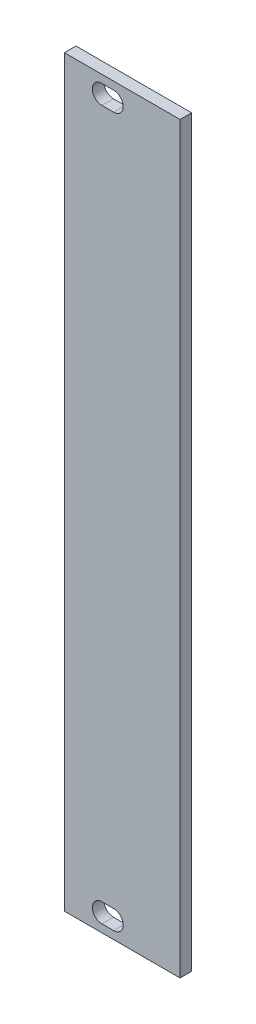
ISO-10303-21;
HEADER;
FILE_DESCRIPTION(('STEP AP214'),'2;1');
FILE_NAME('part.step','',(''),(''),'','','');
FILE_SCHEMA(('AUTOMOTIVE_DESIGN { 1 0 10303 214 1 1 1 1 }'));
ENDSEC;
DATA;
#1=APPLICATION_CONTEXT('core data for automotive mechanical design processes');
#2=APPLICATION_PROTOCOL_DEFINITION('international standard','automotive_design',2000,#1);
#3=PRODUCT_CONTEXT('',#1,'mechanical');
#4=PRODUCT('Part','Part','',(#3));
#5=PRODUCT_RELATED_PRODUCT_CATEGORY('part','',(#4));
#6=PRODUCT_DEFINITION_FORMATION('','',#4);
#7=PRODUCT_DEFINITION_CONTEXT('part definition',#1,'design');
#8=PRODUCT_DEFINITION('design','',#6,#7);
#9=PRODUCT_DEFINITION_SHAPE('','',#8);
#10=(LENGTH_UNIT() NAMED_UNIT(*) SI_UNIT(.MILLI.,.METRE.));
#11=(NAMED_UNIT(*) PLANE_ANGLE_UNIT() SI_UNIT($,.RADIAN.));
#12=(NAMED_UNIT(*) SI_UNIT($,.STERADIAN.) SOLID_ANGLE_UNIT());
#13=UNCERTAINTY_MEASURE_WITH_UNIT(LENGTH_MEASURE(1.E-05),#10,'distance_accuracy_value','');
#14=(GEOMETRIC_REPRESENTATION_CONTEXT(3) GLOBAL_UNCERTAINTY_ASSIGNED_CONTEXT((#13)) GLOBAL_UNIT_ASSIGNED_CONTEXT((#10,
#11,#12)) REPRESENTATION_CONTEXT('',''));
#15=CARTESIAN_POINT('',(0.,0.,0.));
#16=DIRECTION('',(0.,0.,1.));
#17=DIRECTION('',(1.,0.,0.));
#18=AXIS2_PLACEMENT_3D('',#15,#16,#17);
#19=CARTESIAN_POINT('',(0.,0.,2.));
#20=DIRECTION('',(0.,0.,1.));
#21=DIRECTION('',(1.,0.,0.));
#22=AXIS2_PLACEMENT_3D('',#19,#20,#21);
#23=PLANE('',#22);
#24=DIRECTION('',(0.,1.,0.));
#25=VECTOR('',#24,1.);
#26=CARTESIAN_POINT('',(10.,64.25,2.));
#27=LINE('',#26,#25);
#28=CARTESIAN_POINT('',(10.,-64.25,2.));
#29=VERTEX_POINT('',#28);
#30=CARTESIAN_POINT('',(10.,64.25,2.));
#31=VERTEX_POINT('',#30);
#32=EDGE_CURVE('E226',#29,#31,#27,.T.);
#33=ORIENTED_EDGE('',*,*,#32,.T.);
#34=DIRECTION('',(-1.,0.,0.));
#35=VECTOR('',#34,1.);
#36=CARTESIAN_POINT('',(-10.,64.25,2.));
#37=LINE('',#36,#35);
#38=CARTESIAN_POINT('',(-10.,64.25,2.));
#39=VERTEX_POINT('',#38);
#40=EDGE_CURVE('E230',#31,#39,#37,.T.);
#41=ORIENTED_EDGE('',*,*,#40,.T.);
#42=DIRECTION('',(0.,-1.,0.));
#43=VECTOR('',#42,1.);
#44=CARTESIAN_POINT('',(-10.,64.25,2.));
#45=LINE('',#44,#43);
#46=CARTESIAN_POINT('',(-9.99999999999999,-64.25,2.));
#47=VERTEX_POINT('',#46);
#48=EDGE_CURVE('E234',#39,#47,#45,.T.);
#49=ORIENTED_EDGE('',*,*,#48,.T.);
#50=DIRECTION('',(1.,0.,0.));
#51=VECTOR('',#50,1.);
#52=CARTESIAN_POINT('',(-9.99999999999999,-64.25,2.));
#53=LINE('',#52,#51);
#54=EDGE_CURVE('E237',#47,#29,#53,.T.);
#55=ORIENTED_EDGE('',*,*,#54,.T.);
#56=EDGE_LOOP('',(#33,#41,#49,#55));
#57=FACE_BOUND('',#56,.T.);
#58=DIRECTION('',(1.,0.,0.));
#59=VECTOR('',#58,1.);
#60=CARTESIAN_POINT('',(-3.51599999999999,-62.9,2.));
#61=LINE('',#60,#59);
#62=CARTESIAN_POINT('',(-3.51599999999999,-62.9,2.));
#63=VERTEX_POINT('',#62);
#64=CARTESIAN_POINT('',(-1.48399999999999,-62.9,2.));
#65=VERTEX_POINT('',#64);
#66=EDGE_CURVE('E186',#63,#65,#61,.T.);
#67=ORIENTED_EDGE('',*,*,#66,.F.);
#68=CARTESIAN_POINT('',(-3.51599999999999,-61.25,2.));
#69=DIRECTION('',(0.,0.,1.));
#70=DIRECTION('',(1.,0.,0.));
#71=AXIS2_PLACEMENT_3D('',#68,#69,#70);
#72=CIRCLE('',#71,1.65);
#73=CARTESIAN_POINT('',(-3.51599999999999,-59.6,2.));
#74=VERTEX_POINT('',#73);
#75=EDGE_CURVE('E183',#74,#63,#72,.T.);
#76=ORIENTED_EDGE('',*,*,#75,.F.);
#77=DIRECTION('',(-1.,0.,0.));
#78=VECTOR('',#77,1.);
#79=CARTESIAN_POINT('',(-3.51599999999999,-59.6,2.));
#80=LINE('',#79,#78);
#81=CARTESIAN_POINT('',(-1.48399999999999,-59.6,2.));
#82=VERTEX_POINT('',#81);
#83=EDGE_CURVE('E194',#82,#74,#80,.T.);
#84=ORIENTED_EDGE('',*,*,#83,.F.);
#85=CARTESIAN_POINT('',(-1.48399999999999,-61.25,2.));
#86=DIRECTION('',(0.,0.,1.));
#87=DIRECTION('',(1.,0.,0.));
#88=AXIS2_PLACEMENT_3D('',#85,#86,#87);
#89=CIRCLE('',#88,1.65);
#90=EDGE_CURVE('E190',#65,#82,#89,.T.);
#91=ORIENTED_EDGE('',*,*,#90,.F.);
#92=EDGE_LOOP('',(#67,#76,#84,#91));
#93=FACE_BOUND('',#92,.T.);
#94=DIRECTION('',(1.,0.,0.));
#95=VECTOR('',#94,1.);
#96=CARTESIAN_POINT('',(-3.51600000000001,59.6,2.));
#97=LINE('',#96,#95);
#98=CARTESIAN_POINT('',(-3.51600000000001,59.6,2.));
#99=VERTEX_POINT('',#98);
#100=CARTESIAN_POINT('',(-1.48400000000001,59.6,2.));
#101=VERTEX_POINT('',#100);
#102=EDGE_CURVE('E144',#99,#101,#97,.T.);
#103=ORIENTED_EDGE('',*,*,#102,.F.);
#104=CARTESIAN_POINT('',(-3.51600000000001,61.25,2.));
#105=DIRECTION('',(0.,0.,1.));
#106=DIRECTION('',(1.,0.,0.));
#107=AXIS2_PLACEMENT_3D('',#104,#105,#106);
#108=CIRCLE('',#107,1.65);
#109=CARTESIAN_POINT('',(-3.51600000000001,62.9,2.));
#110=VERTEX_POINT('',#109);
#111=EDGE_CURVE('E135',#110,#99,#108,.T.);
#112=ORIENTED_EDGE('',*,*,#111,.F.);
#113=DIRECTION('',(-1.,0.,0.));
#114=VECTOR('',#113,1.);
#115=CARTESIAN_POINT('',(-3.51600000000001,62.9,2.));
#116=LINE('',#115,#114);
#117=CARTESIAN_POINT('',(-1.48400000000001,62.9,2.));
#118=VERTEX_POINT('',#117);
#119=EDGE_CURVE('E161',#118,#110,#116,.T.);
#120=ORIENTED_EDGE('',*,*,#119,.F.);
#121=CARTESIAN_POINT('',(-1.48400000000001,61.25,2.));
#122=DIRECTION('',(0.,0.,1.));
#123=DIRECTION('',(1.,0.,0.));
#124=AXIS2_PLACEMENT_3D('',#121,#122,#123);
#125=CIRCLE('',#124,1.65);
#126=EDGE_CURVE('E157',#101,#118,#125,.T.);
#127=ORIENTED_EDGE('',*,*,#126,.F.);
#128=EDGE_LOOP('',(#103,#112,#120,#127));
#129=FACE_BOUND('',#128,.T.);
#130=ADVANCED_FACE('F45',(#57,#93,#129),#23,.T.);
#131=CARTESIAN_POINT('',(0.,0.,0.));
#132=DIRECTION('',(0.,0.,1.));
#133=DIRECTION('',(1.,0.,0.));
#134=AXIS2_PLACEMENT_3D('',#131,#132,#133);
#135=PLANE('',#134);
#136=CARTESIAN_POINT('',(-3.51599999999999,-61.25,0.));
#137=DIRECTION('',(0.,0.,1.));
#138=DIRECTION('',(1.,0.,0.));
#139=AXIS2_PLACEMENT_3D('',#136,#137,#138);
#140=CIRCLE('',#139,1.65);
#141=CARTESIAN_POINT('',(-3.51599999999999,-59.6,0.));
#142=VERTEX_POINT('',#141);
#143=CARTESIAN_POINT('',(-3.51599999999999,-62.9,0.));
#144=VERTEX_POINT('',#143);
#145=EDGE_CURVE('E153',#142,#144,#140,.T.);
#146=ORIENTED_EDGE('',*,*,#145,.T.);
#147=DIRECTION('',(1.,0.,0.));
#148=VECTOR('',#147,1.);
#149=CARTESIAN_POINT('',(-3.51599999999999,-62.9,0.));
#150=LINE('',#149,#148);
#151=CARTESIAN_POINT('',(-1.48399999999999,-62.9,0.));
#152=VERTEX_POINT('',#151);
#153=EDGE_CURVE('E201',#144,#152,#150,.T.);
#154=ORIENTED_EDGE('',*,*,#153,.T.);
#155=CARTESIAN_POINT('',(-1.48399999999999,-61.25,0.));
#156=DIRECTION('',(0.,0.,1.));
#157=DIRECTION('',(1.,0.,0.));
#158=AXIS2_PLACEMENT_3D('',#155,#156,#157);
#159=CIRCLE('',#158,1.65);
#160=CARTESIAN_POINT('',(-1.48399999999999,-59.6,0.));
#161=VERTEX_POINT('',#160);
#162=EDGE_CURVE('E205',#152,#161,#159,.T.);
#163=ORIENTED_EDGE('',*,*,#162,.T.);
#164=DIRECTION('',(-1.,0.,0.));
#165=VECTOR('',#164,1.);
#166=CARTESIAN_POINT('',(-3.51599999999999,-59.6,0.));
#167=LINE('',#166,#165);
#168=EDGE_CURVE('E187',#161,#142,#167,.T.);
#169=ORIENTED_EDGE('',*,*,#168,.T.);
#170=EDGE_LOOP('',(#146,#154,#163,#169));
#171=FACE_BOUND('',#170,.T.);
#172=DIRECTION('',(0.,1.,0.));
#173=VECTOR('',#172,1.);
#174=CARTESIAN_POINT('',(10.,64.25,0.));
#175=LINE('',#174,#173);
#176=CARTESIAN_POINT('',(10.,-64.25,0.));
#177=VERTEX_POINT('',#176);
#178=CARTESIAN_POINT('',(10.,64.25,0.));
#179=VERTEX_POINT('',#178);
#180=EDGE_CURVE('E225',#177,#179,#175,.T.);
#181=ORIENTED_EDGE('',*,*,#180,.F.);
#182=DIRECTION('',(1.,0.,0.));
#183=VECTOR('',#182,1.);
#184=CARTESIAN_POINT('',(-9.99999999999999,-64.25,0.));
#185=LINE('',#184,#183);
#186=CARTESIAN_POINT('',(-9.99999999999999,-64.25,0.));
#187=VERTEX_POINT('',#186);
#188=EDGE_CURVE('E231',#187,#177,#185,.T.);
#189=ORIENTED_EDGE('',*,*,#188,.F.);
#190=DIRECTION('',(0.,-1.,0.));
#191=VECTOR('',#190,1.);
#192=CARTESIAN_POINT('',(-10.,64.25,0.));
#193=LINE('',#192,#191);
#194=CARTESIAN_POINT('',(-10.,64.25,0.));
#195=VERTEX_POINT('',#194);
#196=EDGE_CURVE('E247',#195,#187,#193,.T.);
#197=ORIENTED_EDGE('',*,*,#196,.F.);
#198=DIRECTION('',(-1.,0.,0.));
#199=VECTOR('',#198,1.);
#200=CARTESIAN_POINT('',(-10.,64.25,0.));
#201=LINE('',#200,#199);
#202=EDGE_CURVE('E244',#179,#195,#201,.T.);
#203=ORIENTED_EDGE('',*,*,#202,.F.);
#204=EDGE_LOOP('',(#181,#189,#197,#203));
#205=FACE_BOUND('',#204,.T.);
#206=CARTESIAN_POINT('',(-3.51600000000001,61.25,0.));
#207=DIRECTION('',(0.,0.,1.));
#208=DIRECTION('',(1.,0.,0.));
#209=AXIS2_PLACEMENT_3D('',#206,#207,#208);
#210=CIRCLE('',#209,1.65);
#211=CARTESIAN_POINT('',(-3.51600000000001,62.9,0.));
#212=VERTEX_POINT('',#211);
#213=CARTESIAN_POINT('',(-3.51600000000001,59.6,0.));
#214=VERTEX_POINT('',#213);
#215=EDGE_CURVE('E69',#212,#214,#210,.T.);
#216=ORIENTED_EDGE('',*,*,#215,.T.);
#217=DIRECTION('',(1.,0.,0.));
#218=VECTOR('',#217,1.);
#219=CARTESIAN_POINT('',(-3.51600000000001,59.6,0.));
#220=LINE('',#219,#218);
#221=CARTESIAN_POINT('',(-1.48400000000001,59.6,0.));
#222=VERTEX_POINT('',#221);
#223=EDGE_CURVE('E151',#214,#222,#220,.T.);
#224=ORIENTED_EDGE('',*,*,#223,.T.);
#225=CARTESIAN_POINT('',(-1.48400000000001,61.25,0.));
#226=DIRECTION('',(0.,0.,1.));
#227=DIRECTION('',(1.,0.,0.));
#228=AXIS2_PLACEMENT_3D('',#225,#226,#227);
#229=CIRCLE('',#228,1.65);
#230=CARTESIAN_POINT('',(-1.48400000000001,62.9,0.));
#231=VERTEX_POINT('',#230);
#232=EDGE_CURVE('E170',#222,#231,#229,.T.);
#233=ORIENTED_EDGE('',*,*,#232,.T.);
#234=DIRECTION('',(-1.,0.,0.));
#235=VECTOR('',#234,1.);
#236=CARTESIAN_POINT('',(-3.51600000000001,62.9,0.));
#237=LINE('',#236,#235);
#238=EDGE_CURVE('E145',#231,#212,#237,.T.);
#239=ORIENTED_EDGE('',*,*,#238,.T.);
#240=EDGE_LOOP('',(#216,#224,#233,#239));
#241=FACE_BOUND('',#240,.T.);
#242=ADVANCED_FACE('F270',(#171,#205,#241),#135,.F.);
#243=CARTESIAN_POINT('',(10.,64.25,2.));
#244=DIRECTION('',(-1.,0.,0.));
#245=DIRECTION('',(0.,0.,1.));
#246=AXIS2_PLACEMENT_3D('',#243,#244,#245);
#247=PLANE('',#246);
#248=ORIENTED_EDGE('',*,*,#180,.T.);
#249=DIRECTION('',(0.,0.,-1.));
#250=VECTOR('',#249,1.);
#251=CARTESIAN_POINT('',(10.,64.25,2.));
#252=LINE('',#251,#250);
#253=EDGE_CURVE('E11',#31,#179,#252,.T.);
#254=ORIENTED_EDGE('',*,*,#253,.F.);
#255=ORIENTED_EDGE('',*,*,#32,.F.);
#256=DIRECTION('',(0.,0.,-1.));
#257=VECTOR('',#256,1.);
#258=CARTESIAN_POINT('',(10.,-64.25,2.));
#259=LINE('',#258,#257);
#260=EDGE_CURVE('E240',#29,#177,#259,.T.);
#261=ORIENTED_EDGE('',*,*,#260,.T.);
#262=EDGE_LOOP('',(#248,#254,#255,#261));
#263=FACE_BOUND('',#262,.T.);
#264=ADVANCED_FACE('F47',(#263),#247,.F.);
#265=CARTESIAN_POINT('',(-10.,64.25,2.));
#266=DIRECTION('',(0.,-1.,0.));
#267=DIRECTION('',(0.,0.,-1.));
#268=AXIS2_PLACEMENT_3D('',#265,#266,#267);
#269=PLANE('',#268);
#270=ORIENTED_EDGE('',*,*,#202,.T.);
#271=DIRECTION('',(0.,0.,-1.));
#272=VECTOR('',#271,1.);
#273=CARTESIAN_POINT('',(-10.,64.25,2.));
#274=LINE('',#273,#272);
#275=EDGE_CURVE('E54',#39,#195,#274,.T.);
#276=ORIENTED_EDGE('',*,*,#275,.F.);
#277=ORIENTED_EDGE('',*,*,#40,.F.);
#278=ORIENTED_EDGE('',*,*,#253,.T.);
#279=EDGE_LOOP('',(#270,#276,#277,#278));
#280=FACE_BOUND('',#279,.T.);
#281=ADVANCED_FACE('F281',(#280),#269,.F.);
#282=CARTESIAN_POINT('',(-10.,64.25,2.));
#283=DIRECTION('',(1.,0.,0.));
#284=DIRECTION('',(0.,1.,0.));
#285=AXIS2_PLACEMENT_3D('',#282,#283,#284);
#286=PLANE('',#285);
#287=ORIENTED_EDGE('',*,*,#196,.T.);
#288=DIRECTION('',(0.,0.,-1.));
#289=VECTOR('',#288,1.);
#290=CARTESIAN_POINT('',(-9.99999999999999,-64.25,2.));
#291=LINE('',#290,#289);
#292=EDGE_CURVE('E255',#47,#187,#291,.T.);
#293=ORIENTED_EDGE('',*,*,#292,.F.);
#294=ORIENTED_EDGE('',*,*,#48,.F.);
#295=ORIENTED_EDGE('',*,*,#275,.T.);
#296=EDGE_LOOP('',(#287,#293,#294,#295));
#297=FACE_BOUND('',#296,.T.);
#298=ADVANCED_FACE('F264',(#297),#286,.F.);
#299=CARTESIAN_POINT('',(-9.99999999999999,-64.25,2.));
#300=DIRECTION('',(0.,1.,0.));
#301=DIRECTION('',(0.,0.,1.));
#302=AXIS2_PLACEMENT_3D('',#299,#300,#301);
#303=PLANE('',#302);
#304=ORIENTED_EDGE('',*,*,#188,.T.);
#305=ORIENTED_EDGE('',*,*,#260,.F.);
#306=ORIENTED_EDGE('',*,*,#54,.F.);
#307=ORIENTED_EDGE('',*,*,#292,.T.);
#308=EDGE_LOOP('',(#304,#305,#306,#307));
#309=FACE_BOUND('',#308,.T.);
#310=ADVANCED_FACE('F274',(#309),#303,.F.);
#311=CARTESIAN_POINT('',(-3.51599999999999,-61.25,2.));
#312=DIRECTION('',(0.,0.,-1.));
#313=DIRECTION('',(-1.,0.,0.));
#314=AXIS2_PLACEMENT_3D('',#311,#312,#313);
#315=CYLINDRICAL_SURFACE('',#314,1.65);
#316=ORIENTED_EDGE('',*,*,#145,.F.);
#317=DIRECTION('',(0.,0.,-1.));
#318=VECTOR('',#317,1.);
#319=CARTESIAN_POINT('',(-3.51599999999999,-59.6,2.));
#320=LINE('',#319,#318);
#321=EDGE_CURVE('E197',#74,#142,#320,.T.);
#322=ORIENTED_EDGE('',*,*,#321,.F.);
#323=ORIENTED_EDGE('',*,*,#75,.T.);
#324=DIRECTION('',(0.,0.,-1.));
#325=VECTOR('',#324,1.);
#326=CARTESIAN_POINT('',(-3.51599999999999,-62.9,2.));
#327=LINE('',#326,#325);
#328=EDGE_CURVE('E221',#63,#144,#327,.T.);
#329=ORIENTED_EDGE('',*,*,#328,.T.);
#330=EDGE_LOOP('',(#316,#322,#323,#329));
#331=FACE_BOUND('',#330,.T.);
#332=ADVANCED_FACE('F296',(#331),#315,.F.);
#333=CARTESIAN_POINT('',(-3.51599999999999,-62.9,2.));
#334=DIRECTION('',(0.,1.,0.));
#335=DIRECTION('',(0.,0.,1.));
#336=AXIS2_PLACEMENT_3D('',#333,#334,#335);
#337=PLANE('',#336);
#338=ORIENTED_EDGE('',*,*,#153,.F.);
#339=ORIENTED_EDGE('',*,*,#328,.F.);
#340=ORIENTED_EDGE('',*,*,#66,.T.);
#341=DIRECTION('',(0.,0.,-1.));
#342=VECTOR('',#341,1.);
#343=CARTESIAN_POINT('',(-1.48399999999999,-62.9,2.));
#344=LINE('',#343,#342);
#345=EDGE_CURVE('E218',#65,#152,#344,.T.);
#346=ORIENTED_EDGE('',*,*,#345,.T.);
#347=EDGE_LOOP('',(#338,#339,#340,#346));
#348=FACE_BOUND('',#347,.T.);
#349=ADVANCED_FACE('F303',(#348),#337,.T.);
#350=CARTESIAN_POINT('',(-1.48399999999999,-61.25,2.));
#351=DIRECTION('',(0.,0.,-1.));
#352=DIRECTION('',(-1.,0.,0.));
#353=AXIS2_PLACEMENT_3D('',#350,#351,#352);
#354=CYLINDRICAL_SURFACE('',#353,1.65);
#355=ORIENTED_EDGE('',*,*,#162,.F.);
#356=ORIENTED_EDGE('',*,*,#345,.F.);
#357=ORIENTED_EDGE('',*,*,#90,.T.);
#358=DIRECTION('',(0.,0.,-1.));
#359=VECTOR('',#358,1.);
#360=CARTESIAN_POINT('',(-1.48399999999999,-59.6,2.));
#361=LINE('',#360,#359);
#362=EDGE_CURVE('E215',#82,#161,#361,.T.);
#363=ORIENTED_EDGE('',*,*,#362,.T.);
#364=EDGE_LOOP('',(#355,#356,#357,#363));
#365=FACE_BOUND('',#364,.T.);
#366=ADVANCED_FACE('F308',(#365),#354,.F.);
#367=CARTESIAN_POINT('',(-3.51599999999999,-59.6,2.));
#368=DIRECTION('',(0.,-1.,0.));
#369=DIRECTION('',(0.,0.,-1.));
#370=AXIS2_PLACEMENT_3D('',#367,#368,#369);
#371=PLANE('',#370);
#372=ORIENTED_EDGE('',*,*,#168,.F.);
#373=ORIENTED_EDGE('',*,*,#362,.F.);
#374=ORIENTED_EDGE('',*,*,#83,.T.);
#375=ORIENTED_EDGE('',*,*,#321,.T.);
#376=EDGE_LOOP('',(#372,#373,#374,#375));
#377=FACE_BOUND('',#376,.T.);
#378=ADVANCED_FACE('F315',(#377),#371,.T.);
#379=CARTESIAN_POINT('',(-3.51600000000001,61.25,2.));
#380=DIRECTION('',(0.,0.,-1.));
#381=DIRECTION('',(-1.,0.,0.));
#382=AXIS2_PLACEMENT_3D('',#379,#380,#381);
#383=CYLINDRICAL_SURFACE('',#382,1.65);
#384=ORIENTED_EDGE('',*,*,#215,.F.);
#385=DIRECTION('',(0.,0.,-1.));
#386=VECTOR('',#385,1.);
#387=CARTESIAN_POINT('',(-3.51600000000001,62.9,2.));
#388=LINE('',#387,#386);
#389=EDGE_CURVE('E139',#110,#212,#388,.T.);
#390=ORIENTED_EDGE('',*,*,#389,.F.);
#391=ORIENTED_EDGE('',*,*,#111,.T.);
#392=DIRECTION('',(0.,0.,-1.));
#393=VECTOR('',#392,1.);
#394=CARTESIAN_POINT('',(-3.51600000000001,59.6,2.));
#395=LINE('',#394,#393);
#396=EDGE_CURVE('E138',#99,#214,#395,.T.);
#397=ORIENTED_EDGE('',*,*,#396,.T.);
#398=EDGE_LOOP('',(#384,#390,#391,#397));
#399=FACE_BOUND('',#398,.T.);
#400=ADVANCED_FACE('F137',(#399),#383,.F.);
#401=CARTESIAN_POINT('',(-3.51600000000001,59.6,2.));
#402=DIRECTION('',(0.,1.,0.));
#403=DIRECTION('',(0.,0.,1.));
#404=AXIS2_PLACEMENT_3D('',#401,#402,#403);
#405=PLANE('',#404);
#406=ORIENTED_EDGE('',*,*,#223,.F.);
#407=ORIENTED_EDGE('',*,*,#396,.F.);
#408=ORIENTED_EDGE('',*,*,#102,.T.);
#409=DIRECTION('',(0.,0.,-1.));
#410=VECTOR('',#409,1.);
#411=CARTESIAN_POINT('',(-1.48400000000001,59.6,2.));
#412=LINE('',#411,#410);
#413=EDGE_CURVE('E154',#101,#222,#412,.T.);
#414=ORIENTED_EDGE('',*,*,#413,.T.);
#415=EDGE_LOOP('',(#406,#407,#408,#414));
#416=FACE_BOUND('',#415,.T.);
#417=ADVANCED_FACE('F148',(#416),#405,.T.);
#418=CARTESIAN_POINT('',(-1.48400000000001,61.25,2.));
#419=DIRECTION('',(0.,0.,-1.));
#420=DIRECTION('',(-1.,0.,0.));
#421=AXIS2_PLACEMENT_3D('',#418,#419,#420);
#422=CYLINDRICAL_SURFACE('',#421,1.65);
#423=ORIENTED_EDGE('',*,*,#232,.F.);
#424=ORIENTED_EDGE('',*,*,#413,.F.);
#425=ORIENTED_EDGE('',*,*,#126,.T.);
#426=DIRECTION('',(0.,0.,-1.));
#427=VECTOR('',#426,1.);
#428=CARTESIAN_POINT('',(-1.48400000000001,62.9,2.));
#429=LINE('',#428,#427);
#430=EDGE_CURVE('E61',#118,#231,#429,.T.);
#431=ORIENTED_EDGE('',*,*,#430,.T.);
#432=EDGE_LOOP('',(#423,#424,#425,#431));
#433=FACE_BOUND('',#432,.T.);
#434=ADVANCED_FACE('F333',(#433),#422,.F.);
#435=CARTESIAN_POINT('',(-3.51600000000001,62.9,2.));
#436=DIRECTION('',(0.,-1.,0.));
#437=DIRECTION('',(0.,0.,-1.));
#438=AXIS2_PLACEMENT_3D('',#435,#436,#437);
#439=PLANE('',#438);
#440=ORIENTED_EDGE('',*,*,#238,.F.);
#441=ORIENTED_EDGE('',*,*,#430,.F.);
#442=ORIENTED_EDGE('',*,*,#119,.T.);
#443=ORIENTED_EDGE('',*,*,#389,.T.);
#444=EDGE_LOOP('',(#440,#441,#442,#443));
#445=FACE_BOUND('',#444,.T.);
#446=ADVANCED_FACE('F336',(#445),#439,.T.);
#447=CLOSED_SHELL('',(#130,#242,#264,#281,#298,#310,#332,#349,#366,#378,#400,#417,#434,#446));
#448=MANIFOLD_SOLID_BREP('B2',#447);
#449=ADVANCED_BREP_SHAPE_REPRESENTATION('',(#18,#448),#14);
#450=SHAPE_DEFINITION_REPRESENTATION(#9,#449);
ENDSEC;
END-ISO-10303-21;
